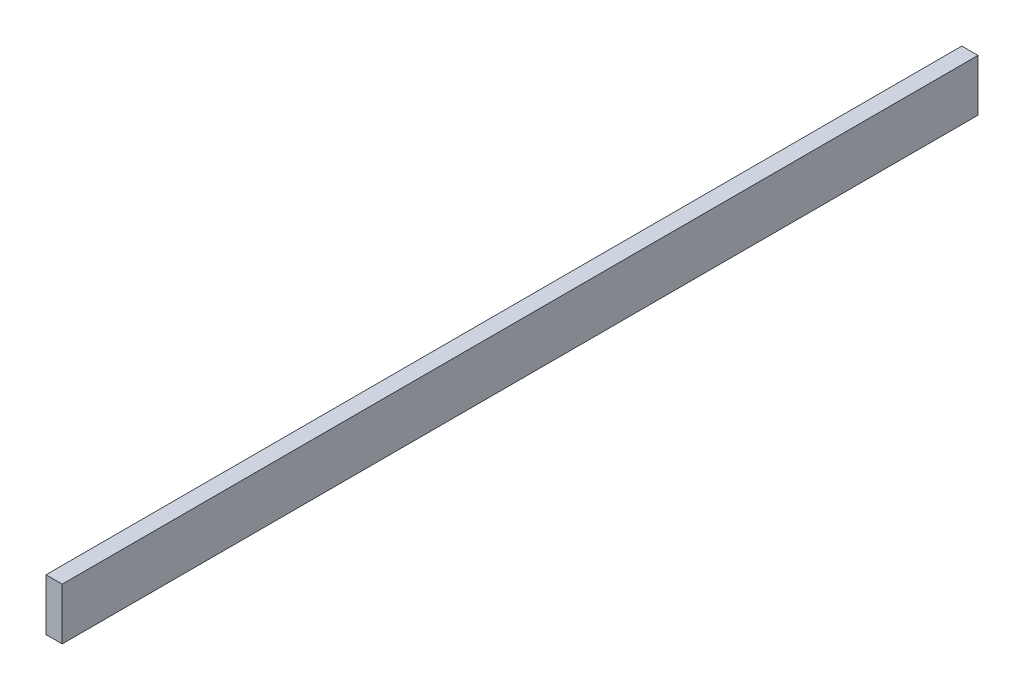
ISO-10303-21;
HEADER;
FILE_DESCRIPTION(('STEP AP214'),'2;1');
FILE_NAME('part.step','',(''),(''),'','','');
FILE_SCHEMA(('AUTOMOTIVE_DESIGN { 1 0 10303 214 1 1 1 1 }'));
ENDSEC;
DATA;
#1=APPLICATION_CONTEXT('core data for automotive mechanical design processes');
#2=APPLICATION_PROTOCOL_DEFINITION('international standard','automotive_design',2000,#1);
#3=PRODUCT_CONTEXT('',#1,'mechanical');
#4=PRODUCT('Part','Part','',(#3));
#5=PRODUCT_RELATED_PRODUCT_CATEGORY('part','',(#4));
#6=PRODUCT_DEFINITION_FORMATION('','',#4);
#7=PRODUCT_DEFINITION_CONTEXT('part definition',#1,'design');
#8=PRODUCT_DEFINITION('design','',#6,#7);
#9=PRODUCT_DEFINITION_SHAPE('','',#8);
#10=(LENGTH_UNIT() NAMED_UNIT(*) SI_UNIT(.MILLI.,.METRE.));
#11=(NAMED_UNIT(*) PLANE_ANGLE_UNIT() SI_UNIT($,.RADIAN.));
#12=(NAMED_UNIT(*) SI_UNIT($,.STERADIAN.) SOLID_ANGLE_UNIT());
#13=UNCERTAINTY_MEASURE_WITH_UNIT(LENGTH_MEASURE(1.E-05),#10,'distance_accuracy_value','');
#14=(GEOMETRIC_REPRESENTATION_CONTEXT(3) GLOBAL_UNCERTAINTY_ASSIGNED_CONTEXT((#13)) GLOBAL_UNIT_ASSIGNED_CONTEXT((#10,
#11,#12)) REPRESENTATION_CONTEXT('',''));
#15=CARTESIAN_POINT('',(0.,0.,0.));
#16=DIRECTION('',(0.,0.,1.));
#17=DIRECTION('',(1.,0.,0.));
#18=AXIS2_PLACEMENT_3D('',#15,#16,#17);
#19=CARTESIAN_POINT('',(3.175,-5.08,-89.789));
#20=DIRECTION('',(0.,0.,1.));
#21=DIRECTION('',(1.,0.,0.));
#22=AXIS2_PLACEMENT_3D('',#19,#20,#21);
#23=PLANE('',#22);
#24=DIRECTION('',(0.,1.,0.));
#25=VECTOR('',#24,1.);
#26=CARTESIAN_POINT('',(0.,-5.08,-89.789));
#27=LINE('',#26,#25);
#28=CARTESIAN_POINT('',(0.,-5.08,-89.789));
#29=VERTEX_POINT('',#28);
#30=CARTESIAN_POINT('',(0.,5.08,-89.789));
#31=VERTEX_POINT('',#30);
#32=EDGE_CURVE('E102',#29,#31,#27,.T.);
#33=ORIENTED_EDGE('',*,*,#32,.T.);
#34=DIRECTION('',(-1.,0.,0.));
#35=VECTOR('',#34,1.);
#36=CARTESIAN_POINT('',(3.175,5.08,-89.789));
#37=LINE('',#36,#35);
#38=CARTESIAN_POINT('',(3.175,5.08,-89.789));
#39=VERTEX_POINT('',#38);
#40=EDGE_CURVE('E11',#39,#31,#37,.T.);
#41=ORIENTED_EDGE('',*,*,#40,.F.);
#42=DIRECTION('',(0.,1.,0.));
#43=VECTOR('',#42,1.);
#44=CARTESIAN_POINT('',(3.175,-5.08,-89.789));
#45=LINE('',#44,#43);
#46=CARTESIAN_POINT('',(3.175,-5.08,-89.789));
#47=VERTEX_POINT('',#46);
#48=EDGE_CURVE('E90',#47,#39,#45,.T.);
#49=ORIENTED_EDGE('',*,*,#48,.F.);
#50=DIRECTION('',(-1.,0.,0.));
#51=VECTOR('',#50,1.);
#52=CARTESIAN_POINT('',(3.175,-5.08,-89.789));
#53=LINE('',#52,#51);
#54=EDGE_CURVE('E98',#47,#29,#53,.T.);
#55=ORIENTED_EDGE('',*,*,#54,.T.);
#56=EDGE_LOOP('',(#33,#41,#49,#55));
#57=FACE_BOUND('',#56,.T.);
#58=ADVANCED_FACE('F39',(#57),#23,.F.);
#59=CARTESIAN_POINT('',(3.175,5.08,89.789));
#60=DIRECTION('',(0.,-1.,0.));
#61=DIRECTION('',(0.,0.,-1.));
#62=AXIS2_PLACEMENT_3D('',#59,#60,#61);
#63=PLANE('',#62);
#64=DIRECTION('',(0.,0.,1.));
#65=VECTOR('',#64,1.);
#66=CARTESIAN_POINT('',(0.,5.08,89.789));
#67=LINE('',#66,#65);
#68=CARTESIAN_POINT('',(0.,5.08,89.789));
#69=VERTEX_POINT('',#68);
#70=EDGE_CURVE('E94',#31,#69,#67,.T.);
#71=ORIENTED_EDGE('',*,*,#70,.T.);
#72=DIRECTION('',(-1.,0.,0.));
#73=VECTOR('',#72,1.);
#74=CARTESIAN_POINT('',(3.175,5.08,89.789));
#75=LINE('',#74,#73);
#76=CARTESIAN_POINT('',(3.175,5.08,89.789));
#77=VERTEX_POINT('',#76);
#78=EDGE_CURVE('E47',#77,#69,#75,.T.);
#79=ORIENTED_EDGE('',*,*,#78,.F.);
#80=DIRECTION('',(0.,0.,1.));
#81=VECTOR('',#80,1.);
#82=CARTESIAN_POINT('',(3.175,5.08,89.789));
#83=LINE('',#82,#81);
#84=EDGE_CURVE('E85',#39,#77,#83,.T.);
#85=ORIENTED_EDGE('',*,*,#84,.F.);
#86=ORIENTED_EDGE('',*,*,#40,.T.);
#87=EDGE_LOOP('',(#71,#79,#85,#86));
#88=FACE_BOUND('',#87,.T.);
#89=ADVANCED_FACE('F93',(#88),#63,.F.);
#90=CARTESIAN_POINT('',(3.175,-5.08,89.789));
#91=DIRECTION('',(0.,0.,-1.));
#92=DIRECTION('',(-1.,0.,0.));
#93=AXIS2_PLACEMENT_3D('',#90,#91,#92);
#94=PLANE('',#93);
#95=DIRECTION('',(0.,-1.,0.));
#96=VECTOR('',#95,1.);
#97=CARTESIAN_POINT('',(0.,-5.08,89.789));
#98=LINE('',#97,#96);
#99=CARTESIAN_POINT('',(0.,-5.08,89.789));
#100=VERTEX_POINT('',#99);
#101=EDGE_CURVE('E72',#69,#100,#98,.T.);
#102=ORIENTED_EDGE('',*,*,#101,.T.);
#103=DIRECTION('',(-1.,0.,0.));
#104=VECTOR('',#103,1.);
#105=CARTESIAN_POINT('',(3.175,-5.08,89.789));
#106=LINE('',#105,#104);
#107=CARTESIAN_POINT('',(3.175,-5.08,89.789));
#108=VERTEX_POINT('',#107);
#109=EDGE_CURVE('E95',#108,#100,#106,.T.);
#110=ORIENTED_EDGE('',*,*,#109,.F.);
#111=DIRECTION('',(0.,-1.,0.));
#112=VECTOR('',#111,1.);
#113=CARTESIAN_POINT('',(3.175,-5.08,89.789));
#114=LINE('',#113,#112);
#115=EDGE_CURVE('E88',#77,#108,#114,.T.);
#116=ORIENTED_EDGE('',*,*,#115,.F.);
#117=ORIENTED_EDGE('',*,*,#78,.T.);
#118=EDGE_LOOP('',(#102,#110,#116,#117));
#119=FACE_BOUND('',#118,.T.);
#120=ADVANCED_FACE('F96',(#119),#94,.F.);
#121=CARTESIAN_POINT('',(3.175,-5.08,89.789));
#122=DIRECTION('',(0.,1.,0.));
#123=DIRECTION('',(0.,0.,1.));
#124=AXIS2_PLACEMENT_3D('',#121,#122,#123);
#125=PLANE('',#124);
#126=DIRECTION('',(0.,0.,-1.));
#127=VECTOR('',#126,1.);
#128=CARTESIAN_POINT('',(0.,-5.08,89.789));
#129=LINE('',#128,#127);
#130=EDGE_CURVE('E78',#100,#29,#129,.T.);
#131=ORIENTED_EDGE('',*,*,#130,.T.);
#132=ORIENTED_EDGE('',*,*,#54,.F.);
#133=DIRECTION('',(0.,0.,-1.));
#134=VECTOR('',#133,1.);
#135=CARTESIAN_POINT('',(3.175,-5.08,89.789));
#136=LINE('',#135,#134);
#137=EDGE_CURVE('E55',#108,#47,#136,.T.);
#138=ORIENTED_EDGE('',*,*,#137,.F.);
#139=ORIENTED_EDGE('',*,*,#109,.T.);
#140=EDGE_LOOP('',(#131,#132,#138,#139));
#141=FACE_BOUND('',#140,.T.);
#142=ADVANCED_FACE('F109',(#141),#125,.F.);
#143=CARTESIAN_POINT('',(3.175,0.,0.));
#144=DIRECTION('',(-1.,0.,0.));
#145=DIRECTION('',(0.,0.,1.));
#146=AXIS2_PLACEMENT_3D('',#143,#144,#145);
#147=PLANE('',#146);
#148=ORIENTED_EDGE('',*,*,#48,.T.);
#149=ORIENTED_EDGE('',*,*,#84,.T.);
#150=ORIENTED_EDGE('',*,*,#115,.T.);
#151=ORIENTED_EDGE('',*,*,#137,.T.);
#152=EDGE_LOOP('',(#148,#149,#150,#151));
#153=FACE_BOUND('',#152,.T.);
#154=ADVANCED_FACE('F86',(#153),#147,.F.);
#155=CARTESIAN_POINT('',(0.,0.,0.));
#156=DIRECTION('',(-1.,0.,0.));
#157=DIRECTION('',(0.,0.,1.));
#158=AXIS2_PLACEMENT_3D('',#155,#156,#157);
#159=PLANE('',#158);
#160=ORIENTED_EDGE('',*,*,#32,.F.);
#161=ORIENTED_EDGE('',*,*,#130,.F.);
#162=ORIENTED_EDGE('',*,*,#101,.F.);
#163=ORIENTED_EDGE('',*,*,#70,.F.);
#164=EDGE_LOOP('',(#160,#161,#162,#163));
#165=FACE_BOUND('',#164,.T.);
#166=ADVANCED_FACE('F112',(#165),#159,.T.);
#167=CLOSED_SHELL('',(#58,#89,#120,#142,#154,#166));
#168=MANIFOLD_SOLID_BREP('B2',#167);
#169=ADVANCED_BREP_SHAPE_REPRESENTATION('',(#18,#168),#14);
#170=SHAPE_DEFINITION_REPRESENTATION(#9,#169);
ENDSEC;
END-ISO-10303-21;
